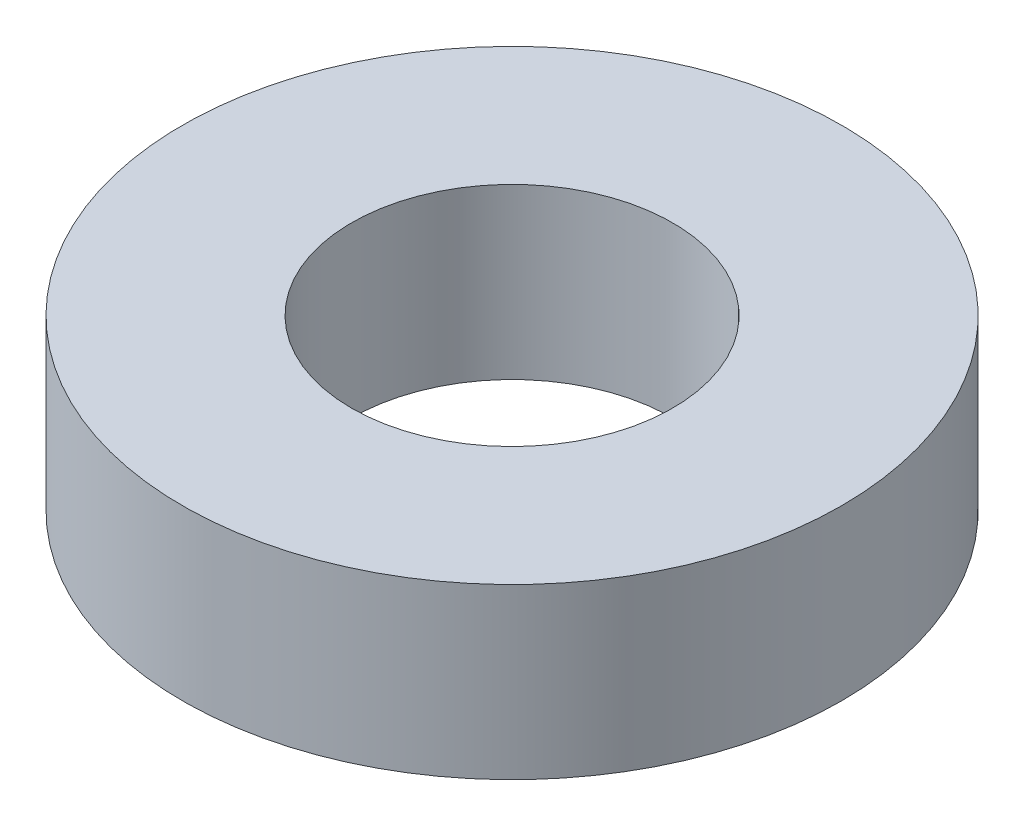
ISO-10303-21;
HEADER;
FILE_DESCRIPTION(('STEP AP214'),'2;1');
FILE_NAME('part.step','',(''),(''),'','','');
FILE_SCHEMA(('AUTOMOTIVE_DESIGN { 1 0 10303 214 1 1 1 1 }'));
ENDSEC;
DATA;
#1=APPLICATION_CONTEXT('core data for automotive mechanical design processes');
#2=APPLICATION_PROTOCOL_DEFINITION('international standard','automotive_design',2000,#1);
#3=PRODUCT_CONTEXT('',#1,'mechanical');
#4=PRODUCT('Part','Part','',(#3));
#5=PRODUCT_RELATED_PRODUCT_CATEGORY('part','',(#4));
#6=PRODUCT_DEFINITION_FORMATION('','',#4);
#7=PRODUCT_DEFINITION_CONTEXT('part definition',#1,'design');
#8=PRODUCT_DEFINITION('design','',#6,#7);
#9=PRODUCT_DEFINITION_SHAPE('','',#8);
#10=(LENGTH_UNIT() NAMED_UNIT(*) SI_UNIT(.MILLI.,.METRE.));
#11=(NAMED_UNIT(*) PLANE_ANGLE_UNIT() SI_UNIT($,.RADIAN.));
#12=(NAMED_UNIT(*) SI_UNIT($,.STERADIAN.) SOLID_ANGLE_UNIT());
#13=UNCERTAINTY_MEASURE_WITH_UNIT(LENGTH_MEASURE(1.E-05),#10,'distance_accuracy_value','');
#14=(GEOMETRIC_REPRESENTATION_CONTEXT(3) GLOBAL_UNCERTAINTY_ASSIGNED_CONTEXT((#13)) GLOBAL_UNIT_ASSIGNED_CONTEXT((#10,
#11,#12)) REPRESENTATION_CONTEXT('',''));
#15=CARTESIAN_POINT('',(0.,0.,0.));
#16=DIRECTION('',(0.,0.,1.));
#17=DIRECTION('',(1.,0.,0.));
#18=AXIS2_PLACEMENT_3D('',#15,#16,#17);
#19=CARTESIAN_POINT('',(0.,2.,0.));
#20=DIRECTION('',(0.,1.,0.));
#21=DIRECTION('',(0.,0.,1.));
#22=AXIS2_PLACEMENT_3D('',#19,#20,#21);
#23=PLANE('',#22);
#24=CARTESIAN_POINT('',(0.,2.,0.));
#25=DIRECTION('',(0.,1.,0.));
#26=DIRECTION('',(1.,0.,0.));
#27=AXIS2_PLACEMENT_3D('',#24,#25,#26);
#28=CIRCLE('',#27,3.9);
#29=CARTESIAN_POINT('',(3.9,2.,0.));
#30=VERTEX_POINT('',#29);
#31=EDGE_CURVE('E11',#30,#30,#28,.T.);
#32=ORIENTED_EDGE('',*,*,#31,.T.);
#33=EDGE_LOOP('',(#32));
#34=FACE_BOUND('',#33,.T.);
#35=CARTESIAN_POINT('',(0.,2.,0.));
#36=DIRECTION('',(0.,1.,0.));
#37=DIRECTION('',(0.,0.,1.));
#38=AXIS2_PLACEMENT_3D('',#35,#36,#37);
#39=CIRCLE('',#38,1.9);
#40=CARTESIAN_POINT('',(0.,2.,1.9));
#41=VERTEX_POINT('',#40);
#42=EDGE_CURVE('E56',#41,#41,#39,.T.);
#43=ORIENTED_EDGE('',*,*,#42,.F.);
#44=EDGE_LOOP('',(#43));
#45=FACE_BOUND('',#44,.T.);
#46=ADVANCED_FACE('F45',(#34,#45),#23,.T.);
#47=CARTESIAN_POINT('',(0.,0.,0.));
#48=DIRECTION('',(0.,1.,0.));
#49=DIRECTION('',(0.,0.,1.));
#50=AXIS2_PLACEMENT_3D('',#47,#48,#49);
#51=PLANE('',#50);
#52=CARTESIAN_POINT('',(0.,0.,0.));
#53=DIRECTION('',(0.,1.,0.));
#54=DIRECTION('',(1.,0.,0.));
#55=AXIS2_PLACEMENT_3D('',#52,#53,#54);
#56=CIRCLE('',#55,3.9);
#57=CARTESIAN_POINT('',(3.9,0.,0.));
#58=VERTEX_POINT('',#57);
#59=EDGE_CURVE('E49',#58,#58,#56,.T.);
#60=ORIENTED_EDGE('',*,*,#59,.F.);
#61=EDGE_LOOP('',(#60));
#62=FACE_BOUND('',#61,.T.);
#63=CARTESIAN_POINT('',(0.,0.,0.));
#64=DIRECTION('',(0.,1.,0.));
#65=DIRECTION('',(0.,0.,1.));
#66=AXIS2_PLACEMENT_3D('',#63,#64,#65);
#67=CIRCLE('',#66,1.9);
#68=CARTESIAN_POINT('',(0.,0.,1.9));
#69=VERTEX_POINT('',#68);
#70=EDGE_CURVE('E58',#69,#69,#67,.T.);
#71=ORIENTED_EDGE('',*,*,#70,.T.);
#72=EDGE_LOOP('',(#71));
#73=FACE_BOUND('',#72,.T.);
#74=ADVANCED_FACE('F68',(#62,#73),#51,.F.);
#75=CARTESIAN_POINT('',(0.,2.,0.));
#76=DIRECTION('',(0.,-1.,0.));
#77=DIRECTION('',(0.,0.,-1.));
#78=AXIS2_PLACEMENT_3D('',#75,#76,#77);
#79=CYLINDRICAL_SURFACE('',#78,3.9);
#80=ORIENTED_EDGE('',*,*,#31,.F.);
#81=EDGE_LOOP('',(#80));
#82=FACE_BOUND('',#81,.T.);
#83=ORIENTED_EDGE('',*,*,#59,.T.);
#84=EDGE_LOOP('',(#83));
#85=FACE_BOUND('',#84,.T.);
#86=ADVANCED_FACE('F47',(#82,#85),#79,.T.);
#87=CARTESIAN_POINT('',(0.,2.,0.));
#88=DIRECTION('',(0.,-1.,0.));
#89=DIRECTION('',(0.,0.,-1.));
#90=AXIS2_PLACEMENT_3D('',#87,#88,#89);
#91=CYLINDRICAL_SURFACE('',#90,1.9);
#92=ORIENTED_EDGE('',*,*,#42,.T.);
#93=EDGE_LOOP('',(#92));
#94=FACE_BOUND('',#93,.T.);
#95=ORIENTED_EDGE('',*,*,#70,.F.);
#96=EDGE_LOOP('',(#95));
#97=FACE_BOUND('',#96,.T.);
#98=ADVANCED_FACE('F64',(#94,#97),#91,.F.);
#99=CLOSED_SHELL('',(#46,#74,#86,#98));
#100=MANIFOLD_SOLID_BREP('B2',#99);
#101=ADVANCED_BREP_SHAPE_REPRESENTATION('',(#18,#100),#14);
#102=SHAPE_DEFINITION_REPRESENTATION(#9,#101);
ENDSEC;
END-ISO-10303-21;
